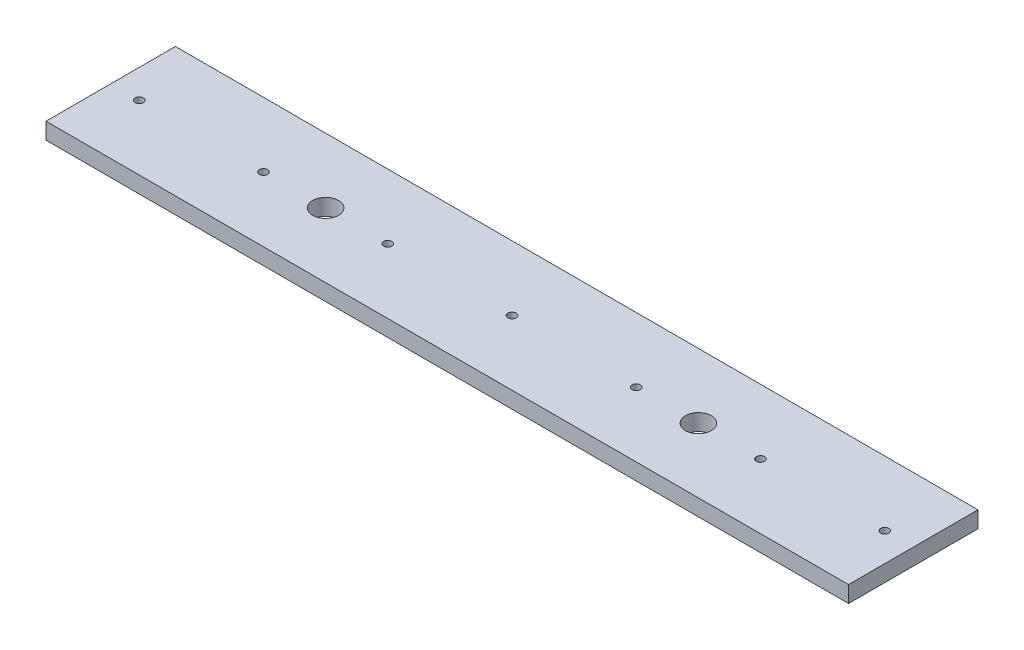
ISO-10303-21;
HEADER;
FILE_DESCRIPTION(('STEP AP214'),'2;1');
FILE_NAME('part.step','',(''),(''),'','','');
FILE_SCHEMA(('AUTOMOTIVE_DESIGN { 1 0 10303 214 1 1 1 1 }'));
ENDSEC;
DATA;
#1=APPLICATION_CONTEXT('core data for automotive mechanical design processes');
#2=APPLICATION_PROTOCOL_DEFINITION('international standard','automotive_design',2000,#1);
#3=PRODUCT_CONTEXT('',#1,'mechanical');
#4=PRODUCT('Part','Part','',(#3));
#5=PRODUCT_RELATED_PRODUCT_CATEGORY('part','',(#4));
#6=PRODUCT_DEFINITION_FORMATION('','',#4);
#7=PRODUCT_DEFINITION_CONTEXT('part definition',#1,'design');
#8=PRODUCT_DEFINITION('design','',#6,#7);
#9=PRODUCT_DEFINITION_SHAPE('','',#8);
#10=(LENGTH_UNIT() NAMED_UNIT(*) SI_UNIT(.MILLI.,.METRE.));
#11=(NAMED_UNIT(*) PLANE_ANGLE_UNIT() SI_UNIT($,.RADIAN.));
#12=(NAMED_UNIT(*) SI_UNIT($,.STERADIAN.) SOLID_ANGLE_UNIT());
#13=UNCERTAINTY_MEASURE_WITH_UNIT(LENGTH_MEASURE(1.E-05),#10,'distance_accuracy_value','');
#14=(GEOMETRIC_REPRESENTATION_CONTEXT(3) GLOBAL_UNCERTAINTY_ASSIGNED_CONTEXT((#13)) GLOBAL_UNIT_ASSIGNED_CONTEXT((#10,
#11,#12)) REPRESENTATION_CONTEXT('',''));
#15=CARTESIAN_POINT('',(0.,0.,0.));
#16=DIRECTION('',(0.,0.,1.));
#17=DIRECTION('',(1.,0.,0.));
#18=AXIS2_PLACEMENT_3D('',#15,#16,#17);
#19=CARTESIAN_POINT('',(155.,6.35,25.));
#20=DIRECTION('',(-1.,0.,0.));
#21=DIRECTION('',(0.,0.,1.));
#22=AXIS2_PLACEMENT_3D('',#19,#20,#21);
#23=PLANE('',#22);
#24=DIRECTION('',(0.,0.,-1.));
#25=VECTOR('',#24,1.);
#26=CARTESIAN_POINT('',(155.,0.,25.));
#27=LINE('',#26,#25);
#28=CARTESIAN_POINT('',(155.,0.,25.));
#29=VERTEX_POINT('',#28);
#30=CARTESIAN_POINT('',(155.,0.,-25.));
#31=VERTEX_POINT('',#30);
#32=EDGE_CURVE('E95',#29,#31,#27,.T.);
#33=ORIENTED_EDGE('',*,*,#32,.T.);
#34=DIRECTION('',(0.,-1.,0.));
#35=VECTOR('',#34,1.);
#36=CARTESIAN_POINT('',(155.,6.35,-25.));
#37=LINE('',#36,#35);
#38=CARTESIAN_POINT('',(155.,6.35,-25.));
#39=VERTEX_POINT('',#38);
#40=EDGE_CURVE('E11',#39,#31,#37,.T.);
#41=ORIENTED_EDGE('',*,*,#40,.F.);
#42=DIRECTION('',(0.,0.,-1.));
#43=VECTOR('',#42,1.);
#44=CARTESIAN_POINT('',(155.,6.35,25.));
#45=LINE('',#44,#43);
#46=CARTESIAN_POINT('',(155.,6.35,25.));
#47=VERTEX_POINT('',#46);
#48=EDGE_CURVE('E83',#47,#39,#45,.T.);
#49=ORIENTED_EDGE('',*,*,#48,.F.);
#50=DIRECTION('',(0.,-1.,0.));
#51=VECTOR('',#50,1.);
#52=CARTESIAN_POINT('',(155.,6.35,25.));
#53=LINE('',#52,#51);
#54=EDGE_CURVE('E91',#47,#29,#53,.T.);
#55=ORIENTED_EDGE('',*,*,#54,.T.);
#56=EDGE_LOOP('',(#33,#41,#49,#55));
#57=FACE_BOUND('',#56,.T.);
#58=ADVANCED_FACE('F32',(#57),#23,.F.);
#59=CARTESIAN_POINT('',(-155.,6.35,-25.));
#60=DIRECTION('',(0.,0.,1.));
#61=DIRECTION('',(1.,0.,0.));
#62=AXIS2_PLACEMENT_3D('',#59,#60,#61);
#63=PLANE('',#62);
#64=DIRECTION('',(-1.,0.,0.));
#65=VECTOR('',#64,1.);
#66=CARTESIAN_POINT('',(-155.,0.,-25.));
#67=LINE('',#66,#65);
#68=CARTESIAN_POINT('',(-155.,0.,-25.));
#69=VERTEX_POINT('',#68);
#70=EDGE_CURVE('E87',#31,#69,#67,.T.);
#71=ORIENTED_EDGE('',*,*,#70,.T.);
#72=DIRECTION('',(0.,-1.,0.));
#73=VECTOR('',#72,1.);
#74=CARTESIAN_POINT('',(-155.,6.35,-25.));
#75=LINE('',#74,#73);
#76=CARTESIAN_POINT('',(-155.,6.35,-25.));
#77=VERTEX_POINT('',#76);
#78=EDGE_CURVE('E40',#77,#69,#75,.T.);
#79=ORIENTED_EDGE('',*,*,#78,.F.);
#80=DIRECTION('',(-1.,0.,0.));
#81=VECTOR('',#80,1.);
#82=CARTESIAN_POINT('',(-155.,6.35,-25.));
#83=LINE('',#82,#81);
#84=EDGE_CURVE('E78',#39,#77,#83,.T.);
#85=ORIENTED_EDGE('',*,*,#84,.F.);
#86=ORIENTED_EDGE('',*,*,#40,.T.);
#87=EDGE_LOOP('',(#71,#79,#85,#86));
#88=FACE_BOUND('',#87,.T.);
#89=ADVANCED_FACE('F86',(#88),#63,.F.);
#90=CARTESIAN_POINT('',(-155.,6.35,25.));
#91=DIRECTION('',(1.,0.,0.));
#92=DIRECTION('',(0.,0.,-1.));
#93=AXIS2_PLACEMENT_3D('',#90,#91,#92);
#94=PLANE('',#93);
#95=DIRECTION('',(0.,0.,1.));
#96=VECTOR('',#95,1.);
#97=CARTESIAN_POINT('',(-155.,0.,25.));
#98=LINE('',#97,#96);
#99=CARTESIAN_POINT('',(-155.,0.,25.));
#100=VERTEX_POINT('',#99);
#101=EDGE_CURVE('E65',#69,#100,#98,.T.);
#102=ORIENTED_EDGE('',*,*,#101,.T.);
#103=DIRECTION('',(0.,-1.,0.));
#104=VECTOR('',#103,1.);
#105=CARTESIAN_POINT('',(-155.,6.35,25.));
#106=LINE('',#105,#104);
#107=CARTESIAN_POINT('',(-155.,6.35,25.));
#108=VERTEX_POINT('',#107);
#109=EDGE_CURVE('E88',#108,#100,#106,.T.);
#110=ORIENTED_EDGE('',*,*,#109,.F.);
#111=DIRECTION('',(0.,0.,1.));
#112=VECTOR('',#111,1.);
#113=CARTESIAN_POINT('',(-155.,6.35,25.));
#114=LINE('',#113,#112);
#115=EDGE_CURVE('E81',#77,#108,#114,.T.);
#116=ORIENTED_EDGE('',*,*,#115,.F.);
#117=ORIENTED_EDGE('',*,*,#78,.T.);
#118=EDGE_LOOP('',(#102,#110,#116,#117));
#119=FACE_BOUND('',#118,.T.);
#120=ADVANCED_FACE('F89',(#119),#94,.F.);
#121=CARTESIAN_POINT('',(-155.,6.35,25.));
#122=DIRECTION('',(0.,0.,-1.));
#123=DIRECTION('',(-1.,0.,0.));
#124=AXIS2_PLACEMENT_3D('',#121,#122,#123);
#125=PLANE('',#124);
#126=DIRECTION('',(1.,0.,0.));
#127=VECTOR('',#126,1.);
#128=CARTESIAN_POINT('',(-155.,0.,25.));
#129=LINE('',#128,#127);
#130=EDGE_CURVE('E71',#100,#29,#129,.T.);
#131=ORIENTED_EDGE('',*,*,#130,.T.);
#132=ORIENTED_EDGE('',*,*,#54,.F.);
#133=DIRECTION('',(1.,0.,0.));
#134=VECTOR('',#133,1.);
#135=CARTESIAN_POINT('',(-155.,6.35,25.));
#136=LINE('',#135,#134);
#137=EDGE_CURVE('E48',#108,#47,#136,.T.);
#138=ORIENTED_EDGE('',*,*,#137,.F.);
#139=ORIENTED_EDGE('',*,*,#109,.T.);
#140=EDGE_LOOP('',(#131,#132,#138,#139));
#141=FACE_BOUND('',#140,.T.);
#142=ADVANCED_FACE('F103',(#141),#125,.F.);
#143=CARTESIAN_POINT('',(0.,6.35,0.));
#144=DIRECTION('',(0.,-1.,0.));
#145=DIRECTION('',(0.,0.,-1.));
#146=AXIS2_PLACEMENT_3D('',#143,#144,#145);
#147=PLANE('',#146);
#148=CARTESIAN_POINT('',(72.,6.35,0.));
#149=DIRECTION('',(0.,1.,0.));
#150=DIRECTION('',(0.,0.,1.));
#151=AXIS2_PLACEMENT_3D('',#148,#149,#150);
#152=CIRCLE('',#151,5.);
#153=CARTESIAN_POINT('',(72.,6.35,5.));
#154=VERTEX_POINT('',#153);
#155=EDGE_CURVE('E157',#154,#154,#152,.T.);
#156=ORIENTED_EDGE('',*,*,#155,.F.);
#157=EDGE_LOOP('',(#156));
#158=FACE_BOUND('',#157,.T.);
#159=CARTESIAN_POINT('',(-72.,6.35,0.));
#160=DIRECTION('',(0.,1.,0.));
#161=DIRECTION('',(0.,0.,1.));
#162=AXIS2_PLACEMENT_3D('',#159,#160,#161);
#163=CIRCLE('',#162,5.);
#164=CARTESIAN_POINT('',(-72.,6.35,5.));
#165=VERTEX_POINT('',#164);
#166=EDGE_CURVE('E151',#165,#165,#163,.T.);
#167=ORIENTED_EDGE('',*,*,#166,.F.);
#168=EDGE_LOOP('',(#167));
#169=FACE_BOUND('',#168,.T.);
#170=CARTESIAN_POINT('',(-96.,6.35,0.));
#171=DIRECTION('',(0.,1.,0.));
#172=DIRECTION('',(0.,0.,1.));
#173=AXIS2_PLACEMENT_3D('',#170,#171,#172);
#174=CIRCLE('',#173,1.5875);
#175=CARTESIAN_POINT('',(-96.,6.35,1.5875));
#176=VERTEX_POINT('',#175);
#177=EDGE_CURVE('E145',#176,#176,#174,.T.);
#178=ORIENTED_EDGE('',*,*,#177,.F.);
#179=EDGE_LOOP('',(#178));
#180=FACE_BOUND('',#179,.T.);
#181=CARTESIAN_POINT('',(-48.,6.35,0.));
#182=DIRECTION('',(0.,1.,0.));
#183=DIRECTION('',(0.,0.,1.));
#184=AXIS2_PLACEMENT_3D('',#181,#182,#183);
#185=CIRCLE('',#184,1.5875);
#186=CARTESIAN_POINT('',(-48.,6.35,1.5875));
#187=VERTEX_POINT('',#186);
#188=EDGE_CURVE('E139',#187,#187,#185,.T.);
#189=ORIENTED_EDGE('',*,*,#188,.F.);
#190=EDGE_LOOP('',(#189));
#191=FACE_BOUND('',#190,.T.);
#192=CARTESIAN_POINT('',(96.,6.35,0.));
#193=DIRECTION('',(0.,1.,0.));
#194=DIRECTION('',(0.,0.,1.));
#195=AXIS2_PLACEMENT_3D('',#192,#193,#194);
#196=CIRCLE('',#195,1.5875);
#197=CARTESIAN_POINT('',(96.,6.35,1.5875));
#198=VERTEX_POINT('',#197);
#199=EDGE_CURVE('E133',#198,#198,#196,.T.);
#200=ORIENTED_EDGE('',*,*,#199,.F.);
#201=EDGE_LOOP('',(#200));
#202=FACE_BOUND('',#201,.T.);
#203=CARTESIAN_POINT('',(48.,6.35,0.));
#204=DIRECTION('',(0.,1.,0.));
#205=DIRECTION('',(0.,0.,1.));
#206=AXIS2_PLACEMENT_3D('',#203,#204,#205);
#207=CIRCLE('',#206,1.5875);
#208=CARTESIAN_POINT('',(48.,6.35,1.5875));
#209=VERTEX_POINT('',#208);
#210=EDGE_CURVE('E127',#209,#209,#207,.T.);
#211=ORIENTED_EDGE('',*,*,#210,.F.);
#212=EDGE_LOOP('',(#211));
#213=FACE_BOUND('',#212,.T.);
#214=CARTESIAN_POINT('',(144.,6.35,0.));
#215=DIRECTION('',(0.,1.,0.));
#216=DIRECTION('',(0.,0.,1.));
#217=AXIS2_PLACEMENT_3D('',#214,#215,#216);
#218=CIRCLE('',#217,1.58749999999999);
#219=CARTESIAN_POINT('',(144.,6.35,1.58749999999999));
#220=VERTEX_POINT('',#219);
#221=EDGE_CURVE('E121',#220,#220,#218,.T.);
#222=ORIENTED_EDGE('',*,*,#221,.F.);
#223=EDGE_LOOP('',(#222));
#224=FACE_BOUND('',#223,.T.);
#225=CARTESIAN_POINT('',(-144.,6.35,0.));
#226=DIRECTION('',(0.,1.,0.));
#227=DIRECTION('',(0.,0.,1.));
#228=AXIS2_PLACEMENT_3D('',#225,#226,#227);
#229=CIRCLE('',#228,1.58749999999999);
#230=CARTESIAN_POINT('',(-144.,6.35,1.58749999999999));
#231=VERTEX_POINT('',#230);
#232=EDGE_CURVE('E115',#231,#231,#229,.T.);
#233=ORIENTED_EDGE('',*,*,#232,.F.);
#234=EDGE_LOOP('',(#233));
#235=FACE_BOUND('',#234,.T.);
#236=CARTESIAN_POINT('',(0.,6.35,0.));
#237=DIRECTION('',(0.,1.,0.));
#238=DIRECTION('',(0.,0.,1.));
#239=AXIS2_PLACEMENT_3D('',#236,#237,#238);
#240=CIRCLE('',#239,1.5875);
#241=CARTESIAN_POINT('',(0.,6.35,1.5875));
#242=VERTEX_POINT('',#241);
#243=EDGE_CURVE('E109',#242,#242,#240,.T.);
#244=ORIENTED_EDGE('',*,*,#243,.F.);
#245=EDGE_LOOP('',(#244));
#246=FACE_BOUND('',#245,.T.);
#247=ORIENTED_EDGE('',*,*,#48,.T.);
#248=ORIENTED_EDGE('',*,*,#84,.T.);
#249=ORIENTED_EDGE('',*,*,#115,.T.);
#250=ORIENTED_EDGE('',*,*,#137,.T.);
#251=EDGE_LOOP('',(#247,#248,#249,#250));
#252=FACE_BOUND('',#251,.T.);
#253=ADVANCED_FACE('F79',(#158,#169,#180,#191,#202,#213,#224,#235,#246,#252),#147,.F.);
#254=CARTESIAN_POINT('',(0.,0.,0.));
#255=DIRECTION('',(0.,-1.,0.));
#256=DIRECTION('',(0.,0.,-1.));
#257=AXIS2_PLACEMENT_3D('',#254,#255,#256);
#258=PLANE('',#257);
#259=CARTESIAN_POINT('',(72.,0.,0.));
#260=DIRECTION('',(0.,1.,0.));
#261=DIRECTION('',(0.,0.,1.));
#262=AXIS2_PLACEMENT_3D('',#259,#260,#261);
#263=CIRCLE('',#262,5.);
#264=CARTESIAN_POINT('',(72.,0.,5.));
#265=VERTEX_POINT('',#264);
#266=EDGE_CURVE('E154',#265,#265,#263,.T.);
#267=ORIENTED_EDGE('',*,*,#266,.T.);
#268=EDGE_LOOP('',(#267));
#269=FACE_BOUND('',#268,.T.);
#270=CARTESIAN_POINT('',(-72.,0.,0.));
#271=DIRECTION('',(0.,1.,0.));
#272=DIRECTION('',(0.,0.,1.));
#273=AXIS2_PLACEMENT_3D('',#270,#271,#272);
#274=CIRCLE('',#273,5.);
#275=CARTESIAN_POINT('',(-72.,0.,5.));
#276=VERTEX_POINT('',#275);
#277=EDGE_CURVE('E148',#276,#276,#274,.T.);
#278=ORIENTED_EDGE('',*,*,#277,.T.);
#279=EDGE_LOOP('',(#278));
#280=FACE_BOUND('',#279,.T.);
#281=CARTESIAN_POINT('',(-96.,0.,0.));
#282=DIRECTION('',(0.,1.,0.));
#283=DIRECTION('',(0.,0.,1.));
#284=AXIS2_PLACEMENT_3D('',#281,#282,#283);
#285=CIRCLE('',#284,1.5875);
#286=CARTESIAN_POINT('',(-96.,0.,1.5875));
#287=VERTEX_POINT('',#286);
#288=EDGE_CURVE('E142',#287,#287,#285,.T.);
#289=ORIENTED_EDGE('',*,*,#288,.T.);
#290=EDGE_LOOP('',(#289));
#291=FACE_BOUND('',#290,.T.);
#292=CARTESIAN_POINT('',(-48.,0.,0.));
#293=DIRECTION('',(0.,1.,0.));
#294=DIRECTION('',(0.,0.,1.));
#295=AXIS2_PLACEMENT_3D('',#292,#293,#294);
#296=CIRCLE('',#295,1.5875);
#297=CARTESIAN_POINT('',(-48.,0.,1.5875));
#298=VERTEX_POINT('',#297);
#299=EDGE_CURVE('E136',#298,#298,#296,.T.);
#300=ORIENTED_EDGE('',*,*,#299,.T.);
#301=EDGE_LOOP('',(#300));
#302=FACE_BOUND('',#301,.T.);
#303=CARTESIAN_POINT('',(96.,0.,0.));
#304=DIRECTION('',(0.,1.,0.));
#305=DIRECTION('',(0.,0.,1.));
#306=AXIS2_PLACEMENT_3D('',#303,#304,#305);
#307=CIRCLE('',#306,1.5875);
#308=CARTESIAN_POINT('',(96.,0.,1.5875));
#309=VERTEX_POINT('',#308);
#310=EDGE_CURVE('E130',#309,#309,#307,.T.);
#311=ORIENTED_EDGE('',*,*,#310,.T.);
#312=EDGE_LOOP('',(#311));
#313=FACE_BOUND('',#312,.T.);
#314=CARTESIAN_POINT('',(48.,0.,0.));
#315=DIRECTION('',(0.,1.,0.));
#316=DIRECTION('',(0.,0.,1.));
#317=AXIS2_PLACEMENT_3D('',#314,#315,#316);
#318=CIRCLE('',#317,1.5875);
#319=CARTESIAN_POINT('',(48.,0.,1.5875));
#320=VERTEX_POINT('',#319);
#321=EDGE_CURVE('E124',#320,#320,#318,.T.);
#322=ORIENTED_EDGE('',*,*,#321,.T.);
#323=EDGE_LOOP('',(#322));
#324=FACE_BOUND('',#323,.T.);
#325=CARTESIAN_POINT('',(144.,0.,0.));
#326=DIRECTION('',(0.,1.,0.));
#327=DIRECTION('',(0.,0.,1.));
#328=AXIS2_PLACEMENT_3D('',#325,#326,#327);
#329=CIRCLE('',#328,1.58749999999999);
#330=CARTESIAN_POINT('',(144.,0.,1.58749999999999));
#331=VERTEX_POINT('',#330);
#332=EDGE_CURVE('E118',#331,#331,#329,.T.);
#333=ORIENTED_EDGE('',*,*,#332,.T.);
#334=EDGE_LOOP('',(#333));
#335=FACE_BOUND('',#334,.T.);
#336=CARTESIAN_POINT('',(-144.,0.,0.));
#337=DIRECTION('',(0.,1.,0.));
#338=DIRECTION('',(0.,0.,1.));
#339=AXIS2_PLACEMENT_3D('',#336,#337,#338);
#340=CIRCLE('',#339,1.58749999999999);
#341=CARTESIAN_POINT('',(-144.,0.,1.58749999999999));
#342=VERTEX_POINT('',#341);
#343=EDGE_CURVE('E112',#342,#342,#340,.T.);
#344=ORIENTED_EDGE('',*,*,#343,.T.);
#345=EDGE_LOOP('',(#344));
#346=FACE_BOUND('',#345,.T.);
#347=CARTESIAN_POINT('',(0.,0.,0.));
#348=DIRECTION('',(0.,1.,0.));
#349=DIRECTION('',(0.,0.,1.));
#350=AXIS2_PLACEMENT_3D('',#347,#348,#349);
#351=CIRCLE('',#350,1.5875);
#352=CARTESIAN_POINT('',(0.,0.,1.5875));
#353=VERTEX_POINT('',#352);
#354=EDGE_CURVE('E98',#353,#353,#351,.T.);
#355=ORIENTED_EDGE('',*,*,#354,.T.);
#356=EDGE_LOOP('',(#355));
#357=FACE_BOUND('',#356,.T.);
#358=ORIENTED_EDGE('',*,*,#32,.F.);
#359=ORIENTED_EDGE('',*,*,#130,.F.);
#360=ORIENTED_EDGE('',*,*,#101,.F.);
#361=ORIENTED_EDGE('',*,*,#70,.F.);
#362=EDGE_LOOP('',(#358,#359,#360,#361));
#363=FACE_BOUND('',#362,.T.);
#364=ADVANCED_FACE('F106',(#269,#280,#291,#302,#313,#324,#335,#346,#357,#363),#258,.T.);
#365=CARTESIAN_POINT('',(0.,0.,0.));
#366=DIRECTION('',(0.,1.,0.));
#367=DIRECTION('',(0.,0.,1.));
#368=AXIS2_PLACEMENT_3D('',#365,#366,#367);
#369=CYLINDRICAL_SURFACE('',#368,1.5875);
#370=ORIENTED_EDGE('',*,*,#354,.F.);
#371=EDGE_LOOP('',(#370));
#372=FACE_BOUND('',#371,.T.);
#373=ORIENTED_EDGE('',*,*,#243,.T.);
#374=EDGE_LOOP('',(#373));
#375=FACE_BOUND('',#374,.T.);
#376=ADVANCED_FACE('F191',(#372,#375),#369,.F.);
#377=CARTESIAN_POINT('',(-144.,0.,0.));
#378=DIRECTION('',(0.,1.,0.));
#379=DIRECTION('',(0.,0.,1.));
#380=AXIS2_PLACEMENT_3D('',#377,#378,#379);
#381=CYLINDRICAL_SURFACE('',#380,1.58749999999999);
#382=ORIENTED_EDGE('',*,*,#343,.F.);
#383=EDGE_LOOP('',(#382));
#384=FACE_BOUND('',#383,.T.);
#385=ORIENTED_EDGE('',*,*,#232,.T.);
#386=EDGE_LOOP('',(#385));
#387=FACE_BOUND('',#386,.T.);
#388=ADVANCED_FACE('F193',(#384,#387),#381,.F.);
#389=CARTESIAN_POINT('',(144.,0.,0.));
#390=DIRECTION('',(0.,1.,0.));
#391=DIRECTION('',(0.,0.,1.));
#392=AXIS2_PLACEMENT_3D('',#389,#390,#391);
#393=CYLINDRICAL_SURFACE('',#392,1.58749999999999);
#394=ORIENTED_EDGE('',*,*,#332,.F.);
#395=EDGE_LOOP('',(#394));
#396=FACE_BOUND('',#395,.T.);
#397=ORIENTED_EDGE('',*,*,#221,.T.);
#398=EDGE_LOOP('',(#397));
#399=FACE_BOUND('',#398,.T.);
#400=ADVANCED_FACE('F200',(#396,#399),#393,.F.);
#401=CARTESIAN_POINT('',(48.,0.,0.));
#402=DIRECTION('',(0.,1.,0.));
#403=DIRECTION('',(0.,0.,1.));
#404=AXIS2_PLACEMENT_3D('',#401,#402,#403);
#405=CYLINDRICAL_SURFACE('',#404,1.5875);
#406=ORIENTED_EDGE('',*,*,#321,.F.);
#407=EDGE_LOOP('',(#406));
#408=FACE_BOUND('',#407,.T.);
#409=ORIENTED_EDGE('',*,*,#210,.T.);
#410=EDGE_LOOP('',(#409));
#411=FACE_BOUND('',#410,.T.);
#412=ADVANCED_FACE('F246',(#408,#411),#405,.F.);
#413=CARTESIAN_POINT('',(96.,0.,0.));
#414=DIRECTION('',(0.,1.,0.));
#415=DIRECTION('',(0.,0.,1.));
#416=AXIS2_PLACEMENT_3D('',#413,#414,#415);
#417=CYLINDRICAL_SURFACE('',#416,1.5875);
#418=ORIENTED_EDGE('',*,*,#310,.F.);
#419=EDGE_LOOP('',(#418));
#420=FACE_BOUND('',#419,.T.);
#421=ORIENTED_EDGE('',*,*,#199,.T.);
#422=EDGE_LOOP('',(#421));
#423=FACE_BOUND('',#422,.T.);
#424=ADVANCED_FACE('F256',(#420,#423),#417,.F.);
#425=CARTESIAN_POINT('',(-48.,0.,0.));
#426=DIRECTION('',(0.,1.,0.));
#427=DIRECTION('',(0.,0.,1.));
#428=AXIS2_PLACEMENT_3D('',#425,#426,#427);
#429=CYLINDRICAL_SURFACE('',#428,1.5875);
#430=ORIENTED_EDGE('',*,*,#299,.F.);
#431=EDGE_LOOP('',(#430));
#432=FACE_BOUND('',#431,.T.);
#433=ORIENTED_EDGE('',*,*,#188,.T.);
#434=EDGE_LOOP('',(#433));
#435=FACE_BOUND('',#434,.T.);
#436=ADVANCED_FACE('F266',(#432,#435),#429,.F.);
#437=CARTESIAN_POINT('',(-96.,0.,0.));
#438=DIRECTION('',(0.,1.,0.));
#439=DIRECTION('',(0.,0.,1.));
#440=AXIS2_PLACEMENT_3D('',#437,#438,#439);
#441=CYLINDRICAL_SURFACE('',#440,1.5875);
#442=ORIENTED_EDGE('',*,*,#288,.F.);
#443=EDGE_LOOP('',(#442));
#444=FACE_BOUND('',#443,.T.);
#445=ORIENTED_EDGE('',*,*,#177,.T.);
#446=EDGE_LOOP('',(#445));
#447=FACE_BOUND('',#446,.T.);
#448=ADVANCED_FACE('F276',(#444,#447),#441,.F.);
#449=CARTESIAN_POINT('',(-72.,0.,0.));
#450=DIRECTION('',(0.,1.,0.));
#451=DIRECTION('',(0.,0.,1.));
#452=AXIS2_PLACEMENT_3D('',#449,#450,#451);
#453=CYLINDRICAL_SURFACE('',#452,5.);
#454=ORIENTED_EDGE('',*,*,#277,.F.);
#455=EDGE_LOOP('',(#454));
#456=FACE_BOUND('',#455,.T.);
#457=ORIENTED_EDGE('',*,*,#166,.T.);
#458=EDGE_LOOP('',(#457));
#459=FACE_BOUND('',#458,.T.);
#460=ADVANCED_FACE('F168',(#456,#459),#453,.F.);
#461=CARTESIAN_POINT('',(72.,0.,0.));
#462=DIRECTION('',(0.,1.,0.));
#463=DIRECTION('',(0.,0.,1.));
#464=AXIS2_PLACEMENT_3D('',#461,#462,#463);
#465=CYLINDRICAL_SURFACE('',#464,5.);
#466=ORIENTED_EDGE('',*,*,#266,.F.);
#467=EDGE_LOOP('',(#466));
#468=FACE_BOUND('',#467,.T.);
#469=ORIENTED_EDGE('',*,*,#155,.T.);
#470=EDGE_LOOP('',(#469));
#471=FACE_BOUND('',#470,.T.);
#472=ADVANCED_FACE('F165',(#468,#471),#465,.F.);
#473=CLOSED_SHELL('',(#58,#89,#120,#142,#253,#364,#376,#388,#400,#412,#424,#436,#448,#460,#472));
#474=MANIFOLD_SOLID_BREP('B2',#473);
#475=ADVANCED_BREP_SHAPE_REPRESENTATION('',(#18,#474),#14);
#476=SHAPE_DEFINITION_REPRESENTATION(#9,#475);
ENDSEC;
END-ISO-10303-21;
